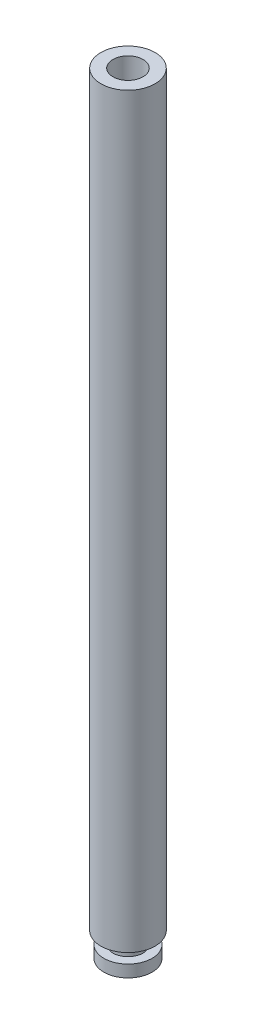
ISO-10303-21;
HEADER;
FILE_DESCRIPTION(('STEP AP214'),'2;1');
FILE_NAME('part.step','',(''),(''),'','','');
FILE_SCHEMA(('AUTOMOTIVE_DESIGN { 1 0 10303 214 1 1 1 1 }'));
ENDSEC;
DATA;
#1=APPLICATION_CONTEXT('core data for automotive mechanical design processes');
#2=APPLICATION_PROTOCOL_DEFINITION('international standard','automotive_design',2000,#1);
#3=PRODUCT_CONTEXT('',#1,'mechanical');
#4=PRODUCT('Part','Part','',(#3));
#5=PRODUCT_RELATED_PRODUCT_CATEGORY('part','',(#4));
#6=PRODUCT_DEFINITION_FORMATION('','',#4);
#7=PRODUCT_DEFINITION_CONTEXT('part definition',#1,'design');
#8=PRODUCT_DEFINITION('design','',#6,#7);
#9=PRODUCT_DEFINITION_SHAPE('','',#8);
#10=(LENGTH_UNIT() NAMED_UNIT(*) SI_UNIT(.MILLI.,.METRE.));
#11=(NAMED_UNIT(*) PLANE_ANGLE_UNIT() SI_UNIT($,.RADIAN.));
#12=(NAMED_UNIT(*) SI_UNIT($,.STERADIAN.) SOLID_ANGLE_UNIT());
#13=UNCERTAINTY_MEASURE_WITH_UNIT(LENGTH_MEASURE(1.E-05),#10,'distance_accuracy_value','');
#14=(GEOMETRIC_REPRESENTATION_CONTEXT(3) GLOBAL_UNCERTAINTY_ASSIGNED_CONTEXT((#13)) GLOBAL_UNIT_ASSIGNED_CONTEXT((#10,
#11,#12)) REPRESENTATION_CONTEXT('',''));
#15=CARTESIAN_POINT('',(0.,0.,0.));
#16=DIRECTION('',(0.,0.,1.));
#17=DIRECTION('',(1.,0.,0.));
#18=AXIS2_PLACEMENT_3D('',#15,#16,#17);
#19=CARTESIAN_POINT('',(-0.522013311509166,62.,-0.51113803418606));
#20=DIRECTION('',(0.,-1.,0.));
#21=DIRECTION('',(0.,0.,-1.));
#22=AXIS2_PLACEMENT_3D('',#19,#20,#21);
#23=CYLINDRICAL_SURFACE('',#22,2.25);
#24=CARTESIAN_POINT('',(-0.522013311509166,62.,-0.51113803418606));
#25=DIRECTION('',(0.,1.,0.));
#26=DIRECTION('',(0.,0.,1.));
#27=AXIS2_PLACEMENT_3D('',#24,#25,#26);
#28=CIRCLE('',#27,2.25);
#29=CARTESIAN_POINT('',(-0.522013311509166,62.,1.73886196581394));
#30=VERTEX_POINT('',#29);
#31=EDGE_CURVE('E53',#30,#30,#28,.T.);
#32=ORIENTED_EDGE('',*,*,#31,.F.);
#33=EDGE_LOOP('',(#32));
#34=FACE_BOUND('',#33,.T.);
#35=CARTESIAN_POINT('',(-0.522013311509166,0.,-0.51113803418606));
#36=DIRECTION('',(0.,1.,0.));
#37=DIRECTION('',(0.,0.,1.));
#38=AXIS2_PLACEMENT_3D('',#35,#36,#37);
#39=CIRCLE('',#38,2.25);
#40=CARTESIAN_POINT('',(-0.522013311509166,0.,1.73886196581394));
#41=VERTEX_POINT('',#40);
#42=EDGE_CURVE('E48',#41,#41,#39,.T.);
#43=ORIENTED_EDGE('',*,*,#42,.T.);
#44=EDGE_LOOP('',(#43));
#45=FACE_BOUND('',#44,.T.);
#46=ADVANCED_FACE('F45',(#34,#45),#23,.T.);
#47=CARTESIAN_POINT('',(-0.522013311509166,62.,-0.51113803418606));
#48=DIRECTION('',(0.,1.,0.));
#49=DIRECTION('',(0.,0.,1.));
#50=AXIS2_PLACEMENT_3D('',#47,#48,#49);
#51=PLANE('',#50);
#52=CARTESIAN_POINT('',(-0.522013311509166,62.,-0.51113803418606));
#53=DIRECTION('',(0.,1.,0.));
#54=DIRECTION('',(0.,0.,1.));
#55=AXIS2_PLACEMENT_3D('',#52,#53,#54);
#56=CIRCLE('',#55,1.25);
#57=CARTESIAN_POINT('',(-0.522013311509166,62.,0.73886196581394));
#58=VERTEX_POINT('',#57);
#59=EDGE_CURVE('E73',#58,#58,#56,.T.);
#60=ORIENTED_EDGE('',*,*,#59,.F.);
#61=EDGE_LOOP('',(#60));
#62=FACE_BOUND('',#61,.T.);
#63=ORIENTED_EDGE('',*,*,#31,.T.);
#64=EDGE_LOOP('',(#63));
#65=FACE_BOUND('',#64,.T.);
#66=ADVANCED_FACE('F90',(#62,#65),#51,.T.);
#67=CARTESIAN_POINT('',(-0.522013311509166,0.,-0.51113803418606));
#68=DIRECTION('',(0.,1.,0.));
#69=DIRECTION('',(0.,0.,1.));
#70=AXIS2_PLACEMENT_3D('',#67,#68,#69);
#71=PLANE('',#70);
#72=CARTESIAN_POINT('',(-0.522013311509166,0.,-0.51113803418606));
#73=DIRECTION('',(0.,-1.,0.));
#74=DIRECTION('',(0.,0.,-1.));
#75=AXIS2_PLACEMENT_3D('',#72,#73,#74);
#76=CIRCLE('',#75,1.25);
#77=CARTESIAN_POINT('',(-0.522013311509166,0.,-1.76113803418606));
#78=VERTEX_POINT('',#77);
#79=EDGE_CURVE('E10',#78,#78,#76,.T.);
#80=ORIENTED_EDGE('',*,*,#79,.F.);
#81=EDGE_LOOP('',(#80));
#82=FACE_BOUND('',#81,.T.);
#83=ORIENTED_EDGE('',*,*,#42,.F.);
#84=EDGE_LOOP('',(#83));
#85=FACE_BOUND('',#84,.T.);
#86=ADVANCED_FACE('F93',(#82,#85),#71,.F.);
#87=CARTESIAN_POINT('',(-0.522013311509166,-1.,-0.51113803418606));
#88=DIRECTION('',(0.,1.,0.));
#89=DIRECTION('',(0.,0.,1.));
#90=AXIS2_PLACEMENT_3D('',#87,#88,#89);
#91=CYLINDRICAL_SURFACE('',#90,1.25);
#92=CARTESIAN_POINT('',(-0.522013311509166,-1.,-0.51113803418606));
#93=DIRECTION('',(0.,-1.,0.));
#94=DIRECTION('',(0.,0.,-1.));
#95=AXIS2_PLACEMENT_3D('',#92,#93,#94);
#96=CIRCLE('',#95,1.25);
#97=CARTESIAN_POINT('',(-0.522013311509166,-1.,-1.76113803418606));
#98=VERTEX_POINT('',#97);
#99=EDGE_CURVE('E60',#98,#98,#96,.T.);
#100=ORIENTED_EDGE('',*,*,#99,.F.);
#101=EDGE_LOOP('',(#100));
#102=FACE_BOUND('',#101,.T.);
#103=ORIENTED_EDGE('',*,*,#79,.T.);
#104=EDGE_LOOP('',(#103));
#105=FACE_BOUND('',#104,.T.);
#106=ADVANCED_FACE('F104',(#102,#105),#91,.T.);
#107=CARTESIAN_POINT('',(-0.522013311509166,-2.,-0.51113803418606));
#108=DIRECTION('',(0.,1.,0.));
#109=DIRECTION('',(0.,0.,1.));
#110=AXIS2_PLACEMENT_3D('',#107,#108,#109);
#111=CYLINDRICAL_SURFACE('',#110,2.);
#112=CARTESIAN_POINT('',(-0.522013311509166,-2.,-0.51113803418606));
#113=DIRECTION('',(0.,-1.,0.));
#114=DIRECTION('',(0.,0.,-1.));
#115=AXIS2_PLACEMENT_3D('',#112,#113,#114);
#116=CIRCLE('',#115,2.);
#117=CARTESIAN_POINT('',(-0.522013311509166,-2.,-2.51113803418606));
#118=VERTEX_POINT('',#117);
#119=EDGE_CURVE('E64',#118,#118,#116,.T.);
#120=ORIENTED_EDGE('',*,*,#119,.F.);
#121=EDGE_LOOP('',(#120));
#122=FACE_BOUND('',#121,.T.);
#123=CARTESIAN_POINT('',(-0.522013311509166,-1.,-0.51113803418606));
#124=DIRECTION('',(0.,-1.,0.));
#125=DIRECTION('',(0.,0.,-1.));
#126=AXIS2_PLACEMENT_3D('',#123,#124,#125);
#127=CIRCLE('',#126,2.);
#128=CARTESIAN_POINT('',(-0.522013311509166,-1.,-2.51113803418606));
#129=VERTEX_POINT('',#128);
#130=EDGE_CURVE('E65',#129,#129,#127,.T.);
#131=ORIENTED_EDGE('',*,*,#130,.T.);
#132=EDGE_LOOP('',(#131));
#133=FACE_BOUND('',#132,.T.);
#134=ADVANCED_FACE('F109',(#122,#133),#111,.T.);
#135=CARTESIAN_POINT('',(-0.522013311509166,-2.,-0.51113803418606));
#136=DIRECTION('',(0.,-1.,0.));
#137=DIRECTION('',(0.,0.,-1.));
#138=AXIS2_PLACEMENT_3D('',#135,#136,#137);
#139=PLANE('',#138);
#140=ORIENTED_EDGE('',*,*,#119,.T.);
#141=EDGE_LOOP('',(#140));
#142=FACE_BOUND('',#141,.T.);
#143=ADVANCED_FACE('F115',(#142),#139,.T.);
#144=CARTESIAN_POINT('',(-0.522013311509166,-1.,-0.51113803418606));
#145=DIRECTION('',(0.,-1.,0.));
#146=DIRECTION('',(0.,0.,-1.));
#147=AXIS2_PLACEMENT_3D('',#144,#145,#146);
#148=PLANE('',#147);
#149=ORIENTED_EDGE('',*,*,#99,.T.);
#150=EDGE_LOOP('',(#149));
#151=FACE_BOUND('',#150,.T.);
#152=ORIENTED_EDGE('',*,*,#130,.F.);
#153=EDGE_LOOP('',(#152));
#154=FACE_BOUND('',#153,.T.);
#155=ADVANCED_FACE('F86',(#151,#154),#148,.F.);
#156=CARTESIAN_POINT('',(-0.522013311509166,57.,-0.51113803418606));
#157=DIRECTION('',(0.,1.,0.));
#158=DIRECTION('',(0.,0.,1.));
#159=AXIS2_PLACEMENT_3D('',#156,#157,#158);
#160=CYLINDRICAL_SURFACE('',#159,1.25);
#161=CARTESIAN_POINT('',(-0.522013311509166,57.,-0.51113803418606));
#162=DIRECTION('',(0.,1.,0.));
#163=DIRECTION('',(0.,0.,1.));
#164=AXIS2_PLACEMENT_3D('',#161,#162,#163);
#165=CIRCLE('',#164,1.25);
#166=CARTESIAN_POINT('',(-0.522013311509166,57.,0.73886196581394));
#167=VERTEX_POINT('',#166);
#168=EDGE_CURVE('E69',#167,#167,#165,.T.);
#169=ORIENTED_EDGE('',*,*,#168,.F.);
#170=EDGE_LOOP('',(#169));
#171=FACE_BOUND('',#170,.T.);
#172=ORIENTED_EDGE('',*,*,#59,.T.);
#173=EDGE_LOOP('',(#172));
#174=FACE_BOUND('',#173,.T.);
#175=ADVANCED_FACE('F83',(#171,#174),#160,.F.);
#176=CARTESIAN_POINT('',(-0.522013311509166,57.,-0.51113803418606));
#177=DIRECTION('',(0.,1.,0.));
#178=DIRECTION('',(0.,0.,1.));
#179=AXIS2_PLACEMENT_3D('',#176,#177,#178);
#180=PLANE('',#179);
#181=ORIENTED_EDGE('',*,*,#168,.T.);
#182=EDGE_LOOP('',(#181));
#183=FACE_BOUND('',#182,.T.);
#184=ADVANCED_FACE('F81',(#183),#180,.T.);
#185=CLOSED_SHELL('',(#46,#66,#86,#106,#134,#143,#155,#175,#184));
#186=MANIFOLD_SOLID_BREP('B2',#185);
#187=ADVANCED_BREP_SHAPE_REPRESENTATION('',(#18,#186),#14);
#188=SHAPE_DEFINITION_REPRESENTATION(#9,#187);
ENDSEC;
END-ISO-10303-21;
